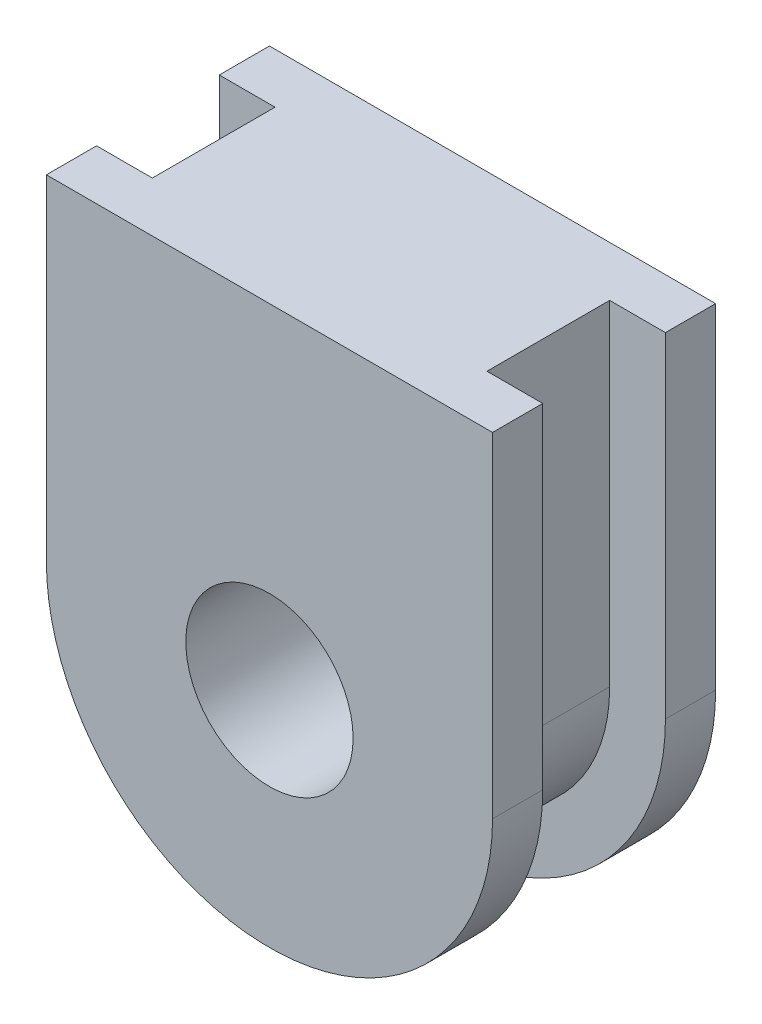
ISO-10303-21;
HEADER;
FILE_DESCRIPTION(('STEP AP214'),'2;1');
FILE_NAME('part.step','',(''),(''),'','','');
FILE_SCHEMA(('AUTOMOTIVE_DESIGN { 1 0 10303 214 1 1 1 1 }'));
ENDSEC;
DATA;
#1=APPLICATION_CONTEXT('core data for automotive mechanical design processes');
#2=APPLICATION_PROTOCOL_DEFINITION('international standard','automotive_design',2000,#1);
#3=PRODUCT_CONTEXT('',#1,'mechanical');
#4=PRODUCT('Part','Part','',(#3));
#5=PRODUCT_RELATED_PRODUCT_CATEGORY('part','',(#4));
#6=PRODUCT_DEFINITION_FORMATION('','',#4);
#7=PRODUCT_DEFINITION_CONTEXT('part definition',#1,'design');
#8=PRODUCT_DEFINITION('design','',#6,#7);
#9=PRODUCT_DEFINITION_SHAPE('','',#8);
#10=(LENGTH_UNIT() NAMED_UNIT(*) SI_UNIT(.MILLI.,.METRE.));
#11=(NAMED_UNIT(*) PLANE_ANGLE_UNIT() SI_UNIT($,.RADIAN.));
#12=(NAMED_UNIT(*) SI_UNIT($,.STERADIAN.) SOLID_ANGLE_UNIT());
#13=UNCERTAINTY_MEASURE_WITH_UNIT(LENGTH_MEASURE(1.E-05),#10,'distance_accuracy_value','');
#14=(GEOMETRIC_REPRESENTATION_CONTEXT(3) GLOBAL_UNCERTAINTY_ASSIGNED_CONTEXT((#13)) GLOBAL_UNIT_ASSIGNED_CONTEXT((#10,
#11,#12)) REPRESENTATION_CONTEXT('',''));
#15=CARTESIAN_POINT('',(0.,0.,0.));
#16=DIRECTION('',(0.,0.,1.));
#17=DIRECTION('',(1.,0.,0.));
#18=AXIS2_PLACEMENT_3D('',#15,#16,#17);
#19=CARTESIAN_POINT('',(0.,0.,2.));
#20=DIRECTION('',(0.,0.,-1.));
#21=DIRECTION('',(-1.,0.,0.));
#22=AXIS2_PLACEMENT_3D('',#19,#20,#21);
#23=CYLINDRICAL_SURFACE('',#22,4.);
#24=CARTESIAN_POINT('',(0.,0.,-1.1));
#25=DIRECTION('',(0.,0.,1.));
#26=DIRECTION('',(1.,0.,0.));
#27=AXIS2_PLACEMENT_3D('',#24,#25,#26);
#28=CIRCLE('',#27,4.);
#29=CARTESIAN_POINT('',(-4.,0.,-1.1));
#30=VERTEX_POINT('',#29);
#31=CARTESIAN_POINT('',(4.,0.,-1.1));
#32=VERTEX_POINT('',#31);
#33=EDGE_CURVE('E181',#30,#32,#28,.T.);
#34=ORIENTED_EDGE('',*,*,#33,.F.);
#35=DIRECTION('',(0.,0.,-1.));
#36=VECTOR('',#35,1.);
#37=CARTESIAN_POINT('',(-4.,0.,2.));
#38=LINE('',#37,#36);
#39=CARTESIAN_POINT('',(-4.,0.,-2.));
#40=VERTEX_POINT('',#39);
#41=EDGE_CURVE('E81',#30,#40,#38,.T.);
#42=ORIENTED_EDGE('',*,*,#41,.T.);
#43=CARTESIAN_POINT('',(0.,0.,-2.));
#44=DIRECTION('',(0.,0.,1.));
#45=DIRECTION('',(1.,0.,0.));
#46=AXIS2_PLACEMENT_3D('',#43,#44,#45);
#47=CIRCLE('',#46,4.);
#48=CARTESIAN_POINT('',(4.,0.,-2.));
#49=VERTEX_POINT('',#48);
#50=EDGE_CURVE('E189',#40,#49,#47,.T.);
#51=ORIENTED_EDGE('',*,*,#50,.T.);
#52=DIRECTION('',(0.,0.,-1.));
#53=VECTOR('',#52,1.);
#54=CARTESIAN_POINT('',(4.,0.,2.));
#55=LINE('',#54,#53);
#56=EDGE_CURVE('E219',#32,#49,#55,.T.);
#57=ORIENTED_EDGE('',*,*,#56,.F.);
#58=EDGE_LOOP('',(#34,#42,#51,#57));
#59=FACE_BOUND('',#58,.T.);
#60=ADVANCED_FACE('F35',(#59),#23,.T.);
#61=CARTESIAN_POINT('',(4.,0.,2.));
#62=DIRECTION('',(-1.,0.,0.));
#63=DIRECTION('',(0.,0.,1.));
#64=AXIS2_PLACEMENT_3D('',#61,#62,#63);
#65=PLANE('',#64);
#66=DIRECTION('',(0.,1.,0.));
#67=VECTOR('',#66,1.);
#68=CARTESIAN_POINT('',(4.,0.,-1.1));
#69=LINE('',#68,#67);
#70=CARTESIAN_POINT('',(4.,6.,-1.1));
#71=VERTEX_POINT('',#70);
#72=EDGE_CURVE('E184',#32,#71,#69,.T.);
#73=ORIENTED_EDGE('',*,*,#72,.F.);
#74=ORIENTED_EDGE('',*,*,#56,.T.);
#75=DIRECTION('',(0.,1.,0.));
#76=VECTOR('',#75,1.);
#77=CARTESIAN_POINT('',(4.,0.,-2.));
#78=LINE('',#77,#76);
#79=CARTESIAN_POINT('',(4.,6.,-2.));
#80=VERTEX_POINT('',#79);
#81=EDGE_CURVE('E201',#49,#80,#78,.T.);
#82=ORIENTED_EDGE('',*,*,#81,.T.);
#83=DIRECTION('',(0.,0.,-1.));
#84=VECTOR('',#83,1.);
#85=CARTESIAN_POINT('',(4.,6.,2.));
#86=LINE('',#85,#84);
#87=EDGE_CURVE('E215',#71,#80,#86,.T.);
#88=ORIENTED_EDGE('',*,*,#87,.F.);
#89=EDGE_LOOP('',(#73,#74,#82,#88));
#90=FACE_BOUND('',#89,.T.);
#91=ADVANCED_FACE('F243',(#90),#65,.F.);
#92=CARTESIAN_POINT('',(-4.,6.,2.));
#93=DIRECTION('',(0.,-1.,0.));
#94=DIRECTION('',(0.,0.,-1.));
#95=AXIS2_PLACEMENT_3D('',#92,#93,#94);
#96=PLANE('',#95);
#97=DIRECTION('',(0.,0.,1.));
#98=VECTOR('',#97,1.);
#99=CARTESIAN_POINT('',(-3.,6.,-1.1));
#100=LINE('',#99,#98);
#101=CARTESIAN_POINT('',(-3.,6.,-1.1));
#102=VERTEX_POINT('',#101);
#103=CARTESIAN_POINT('',(-3.,6.,1.1));
#104=VERTEX_POINT('',#103);
#105=EDGE_CURVE('E157',#102,#104,#100,.T.);
#106=ORIENTED_EDGE('',*,*,#105,.T.);
#107=DIRECTION('',(-1.,0.,0.));
#108=VECTOR('',#107,1.);
#109=CARTESIAN_POINT('',(-4.,6.,1.1));
#110=LINE('',#109,#108);
#111=CARTESIAN_POINT('',(-4.,6.,1.1));
#112=VERTEX_POINT('',#111);
#113=EDGE_CURVE('E168',#104,#112,#110,.T.);
#114=ORIENTED_EDGE('',*,*,#113,.T.);
#115=DIRECTION('',(0.,0.,-1.));
#116=VECTOR('',#115,1.);
#117=CARTESIAN_POINT('',(-4.,6.,2.));
#118=LINE('',#117,#116);
#119=CARTESIAN_POINT('',(-4.,6.,2.));
#120=VERTEX_POINT('',#119);
#121=EDGE_CURVE('E212',#120,#112,#118,.T.);
#122=ORIENTED_EDGE('',*,*,#121,.F.);
#123=DIRECTION('',(-1.,0.,0.));
#124=VECTOR('',#123,1.);
#125=CARTESIAN_POINT('',(-4.,6.,2.));
#126=LINE('',#125,#124);
#127=CARTESIAN_POINT('',(4.,6.,2.));
#128=VERTEX_POINT('',#127);
#129=EDGE_CURVE('E197',#128,#120,#126,.T.);
#130=ORIENTED_EDGE('',*,*,#129,.F.);
#131=CARTESIAN_POINT('',(4.,6.,1.1));
#132=VERTEX_POINT('',#131);
#133=EDGE_CURVE('E216',#128,#132,#86,.T.);
#134=ORIENTED_EDGE('',*,*,#133,.T.);
#135=CARTESIAN_POINT('',(3.,6.,1.1));
#136=VERTEX_POINT('',#135);
#137=EDGE_CURVE('E174',#132,#136,#110,.T.);
#138=ORIENTED_EDGE('',*,*,#137,.T.);
#139=DIRECTION('',(0.,0.,1.));
#140=VECTOR('',#139,1.);
#141=CARTESIAN_POINT('',(3.,6.,-1.1));
#142=LINE('',#141,#140);
#143=CARTESIAN_POINT('',(3.,6.,-1.1));
#144=VERTEX_POINT('',#143);
#145=EDGE_CURVE('E169',#144,#136,#142,.T.);
#146=ORIENTED_EDGE('',*,*,#145,.F.);
#147=DIRECTION('',(-1.,0.,0.));
#148=VECTOR('',#147,1.);
#149=CARTESIAN_POINT('',(-4.,6.,-1.1));
#150=LINE('',#149,#148);
#151=EDGE_CURVE('E182',#71,#144,#150,.T.);
#152=ORIENTED_EDGE('',*,*,#151,.F.);
#153=ORIENTED_EDGE('',*,*,#87,.T.);
#154=DIRECTION('',(-1.,0.,0.));
#155=VECTOR('',#154,1.);
#156=CARTESIAN_POINT('',(-4.,6.,-2.));
#157=LINE('',#156,#155);
#158=CARTESIAN_POINT('',(-4.,6.,-2.));
#159=VERTEX_POINT('',#158);
#160=EDGE_CURVE('E204',#80,#159,#157,.T.);
#161=ORIENTED_EDGE('',*,*,#160,.T.);
#162=CARTESIAN_POINT('',(-4.,6.,-1.1));
#163=VERTEX_POINT('',#162);
#164=EDGE_CURVE('E211',#163,#159,#118,.T.);
#165=ORIENTED_EDGE('',*,*,#164,.F.);
#166=EDGE_CURVE('E179',#102,#163,#150,.T.);
#167=ORIENTED_EDGE('',*,*,#166,.F.);
#168=EDGE_LOOP('',(#106,#114,#122,#130,#134,#138,#146,#152,#153,#161,#165,#167));
#169=FACE_BOUND('',#168,.T.);
#170=ADVANCED_FACE('F233',(#169),#96,.F.);
#171=CARTESIAN_POINT('',(-4.,0.,2.));
#172=DIRECTION('',(1.,0.,0.));
#173=DIRECTION('',(0.,0.,-1.));
#174=AXIS2_PLACEMENT_3D('',#171,#172,#173);
#175=PLANE('',#174);
#176=DIRECTION('',(0.,-1.,0.));
#177=VECTOR('',#176,1.);
#178=CARTESIAN_POINT('',(-4.,0.,-1.1));
#179=LINE('',#178,#177);
#180=EDGE_CURVE('E12',#163,#30,#179,.T.);
#181=ORIENTED_EDGE('',*,*,#180,.F.);
#182=ORIENTED_EDGE('',*,*,#164,.T.);
#183=DIRECTION('',(0.,-1.,0.));
#184=VECTOR('',#183,1.);
#185=CARTESIAN_POINT('',(-4.,0.,-2.));
#186=LINE('',#185,#184);
#187=EDGE_CURVE('E195',#159,#40,#186,.T.);
#188=ORIENTED_EDGE('',*,*,#187,.T.);
#189=ORIENTED_EDGE('',*,*,#41,.F.);
#190=EDGE_LOOP('',(#181,#182,#188,#189));
#191=FACE_BOUND('',#190,.T.);
#192=ADVANCED_FACE('F255',(#191),#175,.F.);
#193=CARTESIAN_POINT('',(0.,0.,2.));
#194=DIRECTION('',(0.,0.,1.));
#195=DIRECTION('',(1.,0.,0.));
#196=AXIS2_PLACEMENT_3D('',#193,#194,#195);
#197=PLANE('',#196);
#198=CARTESIAN_POINT('',(0.,0.,2.));
#199=DIRECTION('',(0.,0.,1.));
#200=DIRECTION('',(1.,0.,0.));
#201=AXIS2_PLACEMENT_3D('',#198,#199,#200);
#202=CIRCLE('',#201,4.);
#203=CARTESIAN_POINT('',(-4.,0.,2.));
#204=VERTEX_POINT('',#203);
#205=CARTESIAN_POINT('',(4.,0.,2.));
#206=VERTEX_POINT('',#205);
#207=EDGE_CURVE('E193',#204,#206,#202,.T.);
#208=ORIENTED_EDGE('',*,*,#207,.T.);
#209=DIRECTION('',(0.,1.,0.));
#210=VECTOR('',#209,1.);
#211=CARTESIAN_POINT('',(4.,0.,2.));
#212=LINE('',#211,#210);
#213=EDGE_CURVE('E89',#206,#128,#212,.T.);
#214=ORIENTED_EDGE('',*,*,#213,.T.);
#215=ORIENTED_EDGE('',*,*,#129,.T.);
#216=DIRECTION('',(0.,-1.,0.));
#217=VECTOR('',#216,1.);
#218=CARTESIAN_POINT('',(-4.,0.,2.));
#219=LINE('',#218,#217);
#220=EDGE_CURVE('E59',#120,#204,#219,.T.);
#221=ORIENTED_EDGE('',*,*,#220,.T.);
#222=EDGE_LOOP('',(#208,#214,#215,#221));
#223=FACE_BOUND('',#222,.T.);
#224=CARTESIAN_POINT('',(0.,0.,2.));
#225=DIRECTION('',(0.,0.,1.));
#226=DIRECTION('',(1.,0.,0.));
#227=AXIS2_PLACEMENT_3D('',#224,#225,#226);
#228=CIRCLE('',#227,1.5);
#229=CARTESIAN_POINT('',(1.5,0.,2.));
#230=VERTEX_POINT('',#229);
#231=EDGE_CURVE('E186',#230,#230,#228,.T.);
#232=ORIENTED_EDGE('',*,*,#231,.F.);
#233=EDGE_LOOP('',(#232));
#234=FACE_BOUND('',#233,.T.);
#235=ADVANCED_FACE('F227',(#223,#234),#197,.T.);
#236=CARTESIAN_POINT('',(0.,0.,-2.));
#237=DIRECTION('',(0.,0.,1.));
#238=DIRECTION('',(1.,0.,0.));
#239=AXIS2_PLACEMENT_3D('',#236,#237,#238);
#240=PLANE('',#239);
#241=ORIENTED_EDGE('',*,*,#50,.F.);
#242=ORIENTED_EDGE('',*,*,#187,.F.);
#243=ORIENTED_EDGE('',*,*,#160,.F.);
#244=ORIENTED_EDGE('',*,*,#81,.F.);
#245=EDGE_LOOP('',(#241,#242,#243,#244));
#246=FACE_BOUND('',#245,.T.);
#247=CARTESIAN_POINT('',(0.,0.,-2.));
#248=DIRECTION('',(0.,0.,1.));
#249=DIRECTION('',(1.,0.,0.));
#250=AXIS2_PLACEMENT_3D('',#247,#248,#249);
#251=CIRCLE('',#250,1.5);
#252=CARTESIAN_POINT('',(1.5,0.,-2.));
#253=VERTEX_POINT('',#252);
#254=EDGE_CURVE('E190',#253,#253,#251,.T.);
#255=ORIENTED_EDGE('',*,*,#254,.T.);
#256=EDGE_LOOP('',(#255));
#257=FACE_BOUND('',#256,.T.);
#258=ADVANCED_FACE('F250',(#246,#257),#240,.F.);
#259=CARTESIAN_POINT('',(-4.,0.,1.1));
#260=VERTEX_POINT('',#259);
#261=EDGE_CURVE('E208',#204,#260,#38,.T.);
#262=ORIENTED_EDGE('',*,*,#261,.T.);
#263=CARTESIAN_POINT('',(0.,0.,1.1));
#264=DIRECTION('',(0.,0.,1.));
#265=DIRECTION('',(1.,0.,0.));
#266=AXIS2_PLACEMENT_3D('',#263,#264,#265);
#267=CIRCLE('',#266,4.);
#268=CARTESIAN_POINT('',(4.,0.,1.1));
#269=VERTEX_POINT('',#268);
#270=EDGE_CURVE('E50',#260,#269,#267,.T.);
#271=ORIENTED_EDGE('',*,*,#270,.T.);
#272=EDGE_CURVE('E220',#206,#269,#55,.T.);
#273=ORIENTED_EDGE('',*,*,#272,.F.);
#274=ORIENTED_EDGE('',*,*,#207,.F.);
#275=EDGE_LOOP('',(#262,#271,#273,#274));
#276=FACE_BOUND('',#275,.T.);
#277=ADVANCED_FACE('F37',(#276),#23,.T.);
#278=ORIENTED_EDGE('',*,*,#272,.T.);
#279=DIRECTION('',(0.,1.,0.));
#280=VECTOR('',#279,1.);
#281=CARTESIAN_POINT('',(4.,0.,1.1));
#282=LINE('',#281,#280);
#283=EDGE_CURVE('E176',#269,#132,#282,.T.);
#284=ORIENTED_EDGE('',*,*,#283,.T.);
#285=ORIENTED_EDGE('',*,*,#133,.F.);
#286=ORIENTED_EDGE('',*,*,#213,.F.);
#287=EDGE_LOOP('',(#278,#284,#285,#286));
#288=FACE_BOUND('',#287,.T.);
#289=ADVANCED_FACE('F230',(#288),#65,.F.);
#290=ORIENTED_EDGE('',*,*,#121,.T.);
#291=DIRECTION('',(0.,-1.,0.));
#292=VECTOR('',#291,1.);
#293=CARTESIAN_POINT('',(-4.,0.,1.1));
#294=LINE('',#293,#292);
#295=EDGE_CURVE('E43',#112,#260,#294,.T.);
#296=ORIENTED_EDGE('',*,*,#295,.T.);
#297=ORIENTED_EDGE('',*,*,#261,.F.);
#298=ORIENTED_EDGE('',*,*,#220,.F.);
#299=EDGE_LOOP('',(#290,#296,#297,#298));
#300=FACE_BOUND('',#299,.T.);
#301=ADVANCED_FACE('F222',(#300),#175,.F.);
#302=CARTESIAN_POINT('',(0.,0.,2.));
#303=DIRECTION('',(0.,0.,-1.));
#304=DIRECTION('',(-1.,0.,0.));
#305=AXIS2_PLACEMENT_3D('',#302,#303,#304);
#306=CYLINDRICAL_SURFACE('',#305,1.5);
#307=ORIENTED_EDGE('',*,*,#231,.T.);
#308=EDGE_LOOP('',(#307));
#309=FACE_BOUND('',#308,.T.);
#310=ORIENTED_EDGE('',*,*,#254,.F.);
#311=EDGE_LOOP('',(#310));
#312=FACE_BOUND('',#311,.T.);
#313=ADVANCED_FACE('F274',(#309,#312),#306,.F.);
#314=CARTESIAN_POINT('',(-11.6434379922521,-5.10062652006793,-1.1));
#315=DIRECTION('',(0.,0.,1.));
#316=DIRECTION('',(1.,0.,0.));
#317=AXIS2_PLACEMENT_3D('',#314,#315,#316);
#318=PLANE('',#317);
#319=ORIENTED_EDGE('',*,*,#151,.T.);
#320=DIRECTION('',(0.,1.,0.));
#321=VECTOR('',#320,1.);
#322=CARTESIAN_POINT('',(3.,6.,-1.1));
#323=LINE('',#322,#321);
#324=CARTESIAN_POINT('',(3.,0.,-1.1));
#325=VERTEX_POINT('',#324);
#326=EDGE_CURVE('E145',#325,#144,#323,.T.);
#327=ORIENTED_EDGE('',*,*,#326,.F.);
#328=CARTESIAN_POINT('',(0.,0.,-1.1));
#329=DIRECTION('',(0.,0.,1.));
#330=DIRECTION('',(1.,0.,0.));
#331=AXIS2_PLACEMENT_3D('',#328,#329,#330);
#332=CIRCLE('',#331,3.);
#333=CARTESIAN_POINT('',(-3.,0.,-1.1));
#334=VERTEX_POINT('',#333);
#335=EDGE_CURVE('E138',#334,#325,#332,.T.);
#336=ORIENTED_EDGE('',*,*,#335,.F.);
#337=DIRECTION('',(0.,-1.,0.));
#338=VECTOR('',#337,1.);
#339=CARTESIAN_POINT('',(-3.,6.,-1.1));
#340=LINE('',#339,#338);
#341=EDGE_CURVE('E150',#102,#334,#340,.T.);
#342=ORIENTED_EDGE('',*,*,#341,.F.);
#343=ORIENTED_EDGE('',*,*,#166,.T.);
#344=ORIENTED_EDGE('',*,*,#180,.T.);
#345=ORIENTED_EDGE('',*,*,#33,.T.);
#346=ORIENTED_EDGE('',*,*,#72,.T.);
#347=EDGE_LOOP('',(#319,#327,#336,#342,#343,#344,#345,#346));
#348=FACE_BOUND('',#347,.T.);
#349=ADVANCED_FACE('F149',(#348),#318,.T.);
#350=CARTESIAN_POINT('',(-11.6434379922521,-5.10062652006793,1.1));
#351=DIRECTION('',(0.,0.,1.));
#352=DIRECTION('',(1.,0.,0.));
#353=AXIS2_PLACEMENT_3D('',#350,#351,#352);
#354=PLANE('',#353);
#355=ORIENTED_EDGE('',*,*,#283,.F.);
#356=ORIENTED_EDGE('',*,*,#270,.F.);
#357=ORIENTED_EDGE('',*,*,#295,.F.);
#358=ORIENTED_EDGE('',*,*,#113,.F.);
#359=DIRECTION('',(0.,-1.,0.));
#360=VECTOR('',#359,1.);
#361=CARTESIAN_POINT('',(-3.,6.,1.1));
#362=LINE('',#361,#360);
#363=CARTESIAN_POINT('',(-3.,0.,1.1));
#364=VERTEX_POINT('',#363);
#365=EDGE_CURVE('E164',#104,#364,#362,.T.);
#366=ORIENTED_EDGE('',*,*,#365,.T.);
#367=CARTESIAN_POINT('',(0.,0.,1.1));
#368=DIRECTION('',(0.,0.,1.));
#369=DIRECTION('',(1.,0.,0.));
#370=AXIS2_PLACEMENT_3D('',#367,#368,#369);
#371=CIRCLE('',#370,3.);
#372=CARTESIAN_POINT('',(3.,0.,1.1));
#373=VERTEX_POINT('',#372);
#374=EDGE_CURVE('E140',#364,#373,#371,.T.);
#375=ORIENTED_EDGE('',*,*,#374,.T.);
#376=DIRECTION('',(0.,1.,0.));
#377=VECTOR('',#376,1.);
#378=CARTESIAN_POINT('',(3.,6.,1.1));
#379=LINE('',#378,#377);
#380=EDGE_CURVE('E158',#373,#136,#379,.T.);
#381=ORIENTED_EDGE('',*,*,#380,.T.);
#382=ORIENTED_EDGE('',*,*,#137,.F.);
#383=EDGE_LOOP('',(#355,#356,#357,#358,#366,#375,#381,#382));
#384=FACE_BOUND('',#383,.T.);
#385=ADVANCED_FACE('F234',(#384),#354,.F.);
#386=CARTESIAN_POINT('',(-3.,6.,-1.1));
#387=DIRECTION('',(-1.,0.,0.));
#388=DIRECTION('',(0.,-1.,0.));
#389=AXIS2_PLACEMENT_3D('',#386,#387,#388);
#390=PLANE('',#389);
#391=ORIENTED_EDGE('',*,*,#365,.F.);
#392=ORIENTED_EDGE('',*,*,#105,.F.);
#393=ORIENTED_EDGE('',*,*,#341,.T.);
#394=DIRECTION('',(0.,0.,1.));
#395=VECTOR('',#394,1.);
#396=CARTESIAN_POINT('',(-3.,0.,-1.1));
#397=LINE('',#396,#395);
#398=EDGE_CURVE('E135',#334,#364,#397,.T.);
#399=ORIENTED_EDGE('',*,*,#398,.T.);
#400=EDGE_LOOP('',(#391,#392,#393,#399));
#401=FACE_BOUND('',#400,.T.);
#402=ADVANCED_FACE('F155',(#401),#390,.T.);
#403=CARTESIAN_POINT('',(3.,6.,-1.1));
#404=DIRECTION('',(1.,0.,0.));
#405=DIRECTION('',(0.,1.,0.));
#406=AXIS2_PLACEMENT_3D('',#403,#404,#405);
#407=PLANE('',#406);
#408=ORIENTED_EDGE('',*,*,#380,.F.);
#409=DIRECTION('',(0.,0.,1.));
#410=VECTOR('',#409,1.);
#411=CARTESIAN_POINT('',(3.,0.,-1.1));
#412=LINE('',#411,#410);
#413=EDGE_CURVE('E144',#325,#373,#412,.T.);
#414=ORIENTED_EDGE('',*,*,#413,.F.);
#415=ORIENTED_EDGE('',*,*,#326,.T.);
#416=ORIENTED_EDGE('',*,*,#145,.T.);
#417=EDGE_LOOP('',(#408,#414,#415,#416));
#418=FACE_BOUND('',#417,.T.);
#419=ADVANCED_FACE('F237',(#418),#407,.T.);
#420=CARTESIAN_POINT('',(0.,0.,-1.1));
#421=DIRECTION('',(0.,0.,1.));
#422=DIRECTION('',(1.,0.,0.));
#423=AXIS2_PLACEMENT_3D('',#420,#421,#422);
#424=CYLINDRICAL_SURFACE('',#423,3.);
#425=ORIENTED_EDGE('',*,*,#374,.F.);
#426=ORIENTED_EDGE('',*,*,#398,.F.);
#427=ORIENTED_EDGE('',*,*,#335,.T.);
#428=ORIENTED_EDGE('',*,*,#413,.T.);
#429=EDGE_LOOP('',(#425,#426,#427,#428));
#430=FACE_BOUND('',#429,.T.);
#431=ADVANCED_FACE('F137',(#430),#424,.T.);
#432=CLOSED_SHELL('',(#60,#91,#170,#192,#235,#258,#277,#289,#301,#313,#349,#385,#402,#419,#431));
#433=MANIFOLD_SOLID_BREP('B2',#432);
#434=ADVANCED_BREP_SHAPE_REPRESENTATION('',(#18,#433),#14);
#435=SHAPE_DEFINITION_REPRESENTATION(#9,#434);
ENDSEC;
END-ISO-10303-21;
